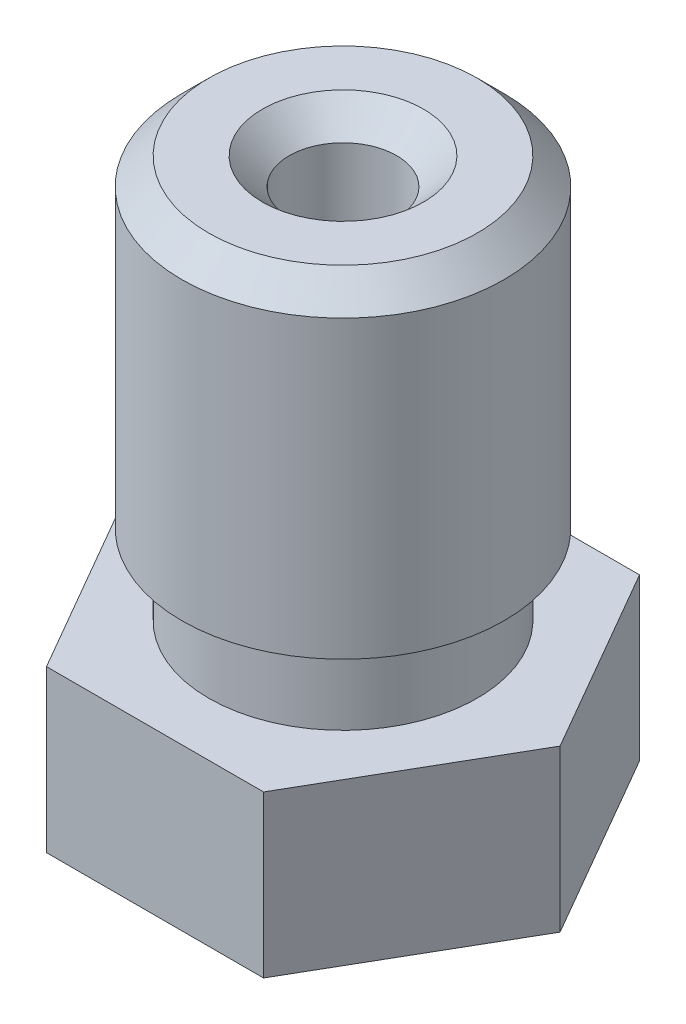
ISO-10303-21;
HEADER;
FILE_DESCRIPTION(('STEP AP214'),'2;1');
FILE_NAME('part.step','',(''),(''),'','','');
FILE_SCHEMA(('AUTOMOTIVE_DESIGN { 1 0 10303 214 1 1 1 1 }'));
ENDSEC;
DATA;
#1=APPLICATION_CONTEXT('core data for automotive mechanical design processes');
#2=APPLICATION_PROTOCOL_DEFINITION('international standard','automotive_design',2000,#1);
#3=PRODUCT_CONTEXT('',#1,'mechanical');
#4=PRODUCT('Part','Part','',(#3));
#5=PRODUCT_RELATED_PRODUCT_CATEGORY('part','',(#4));
#6=PRODUCT_DEFINITION_FORMATION('','',#4);
#7=PRODUCT_DEFINITION_CONTEXT('part definition',#1,'design');
#8=PRODUCT_DEFINITION('design','',#6,#7);
#9=PRODUCT_DEFINITION_SHAPE('','',#8);
#10=(LENGTH_UNIT() NAMED_UNIT(*) SI_UNIT(.MILLI.,.METRE.));
#11=(NAMED_UNIT(*) PLANE_ANGLE_UNIT() SI_UNIT($,.RADIAN.));
#12=(NAMED_UNIT(*) SI_UNIT($,.STERADIAN.) SOLID_ANGLE_UNIT());
#13=UNCERTAINTY_MEASURE_WITH_UNIT(LENGTH_MEASURE(1.E-05),#10,'distance_accuracy_value','');
#14=(GEOMETRIC_REPRESENTATION_CONTEXT(3) GLOBAL_UNCERTAINTY_ASSIGNED_CONTEXT((#13)) GLOBAL_UNIT_ASSIGNED_CONTEXT((#10,
#11,#12)) REPRESENTATION_CONTEXT('',''));
#15=CARTESIAN_POINT('',(0.,0.,0.));
#16=DIRECTION('',(0.,0.,1.));
#17=DIRECTION('',(1.,0.,0.));
#18=AXIS2_PLACEMENT_3D('',#15,#16,#17);
#19=CARTESIAN_POINT('',(2.02072594216369,3.,3.5));
#20=DIRECTION('',(0.,0.,1.));
#21=DIRECTION('',(1.,0.,0.));
#22=AXIS2_PLACEMENT_3D('',#19,#20,#21);
#23=PLANE('',#22);
#24=DIRECTION('',(-1.,0.,0.));
#25=VECTOR('',#24,1.);
#26=CARTESIAN_POINT('',(2.02072594216369,0.,3.5));
#27=LINE('',#26,#25);
#28=CARTESIAN_POINT('',(2.02072594216369,0.,3.5));
#29=VERTEX_POINT('',#28);
#30=CARTESIAN_POINT('',(-2.02072594216369,0.,3.5));
#31=VERTEX_POINT('',#30);
#32=EDGE_CURVE('E123',#29,#31,#27,.T.);
#33=ORIENTED_EDGE('',*,*,#32,.F.);
#34=DIRECTION('',(0.,-1.,0.));
#35=VECTOR('',#34,1.);
#36=CARTESIAN_POINT('',(2.02072594216369,3.,3.5));
#37=LINE('',#36,#35);
#38=CARTESIAN_POINT('',(2.02072594216369,3.,3.5));
#39=VERTEX_POINT('',#38);
#40=EDGE_CURVE('E52',#39,#29,#37,.T.);
#41=ORIENTED_EDGE('',*,*,#40,.F.);
#42=DIRECTION('',(-1.,0.,0.));
#43=VECTOR('',#42,1.);
#44=CARTESIAN_POINT('',(2.02072594216369,3.,3.5));
#45=LINE('',#44,#43);
#46=CARTESIAN_POINT('',(-2.02072594216369,3.,3.5));
#47=VERTEX_POINT('',#46);
#48=EDGE_CURVE('E139',#39,#47,#45,.T.);
#49=ORIENTED_EDGE('',*,*,#48,.T.);
#50=DIRECTION('',(0.,-1.,0.));
#51=VECTOR('',#50,1.);
#52=CARTESIAN_POINT('',(-2.02072594216369,3.,3.5));
#53=LINE('',#52,#51);
#54=EDGE_CURVE('E87',#47,#31,#53,.T.);
#55=ORIENTED_EDGE('',*,*,#54,.T.);
#56=EDGE_LOOP('',(#33,#41,#49,#55));
#57=FACE_BOUND('',#56,.T.);
#58=ADVANCED_FACE('F35',(#57),#23,.T.);
#59=CARTESIAN_POINT('',(4.04145188432738,3.,0.));
#60=DIRECTION('',(0.866025403784439,0.,0.5));
#61=DIRECTION('',(0.5,0.,-0.866025403784439));
#62=AXIS2_PLACEMENT_3D('',#59,#60,#61);
#63=PLANE('',#62);
#64=DIRECTION('',(-0.5,0.,0.866025403784439));
#65=VECTOR('',#64,1.);
#66=CARTESIAN_POINT('',(4.04145188432738,0.,0.));
#67=LINE('',#66,#65);
#68=CARTESIAN_POINT('',(4.04145188432738,0.,0.));
#69=VERTEX_POINT('',#68);
#70=EDGE_CURVE('E136',#69,#29,#67,.T.);
#71=ORIENTED_EDGE('',*,*,#70,.F.);
#72=DIRECTION('',(0.,-1.,0.));
#73=VECTOR('',#72,1.);
#74=CARTESIAN_POINT('',(4.04145188432738,3.,0.));
#75=LINE('',#74,#73);
#76=CARTESIAN_POINT('',(4.04145188432738,3.,0.));
#77=VERTEX_POINT('',#76);
#78=EDGE_CURVE('E75',#77,#69,#75,.T.);
#79=ORIENTED_EDGE('',*,*,#78,.F.);
#80=DIRECTION('',(-0.5,0.,0.866025403784439));
#81=VECTOR('',#80,1.);
#82=CARTESIAN_POINT('',(4.04145188432738,3.,0.));
#83=LINE('',#82,#81);
#84=EDGE_CURVE('E113',#77,#39,#83,.T.);
#85=ORIENTED_EDGE('',*,*,#84,.T.);
#86=ORIENTED_EDGE('',*,*,#40,.T.);
#87=EDGE_LOOP('',(#71,#79,#85,#86));
#88=FACE_BOUND('',#87,.T.);
#89=ADVANCED_FACE('F212',(#88),#63,.T.);
#90=CARTESIAN_POINT('',(2.02072594216369,3.,-3.5));
#91=DIRECTION('',(0.866025403784438,0.,-0.500000000000001));
#92=DIRECTION('',(-0.500000000000001,0.,-0.866025403784438));
#93=AXIS2_PLACEMENT_3D('',#90,#91,#92);
#94=PLANE('',#93);
#95=DIRECTION('',(0.500000000000001,0.,0.866025403784438));
#96=VECTOR('',#95,1.);
#97=CARTESIAN_POINT('',(2.02072594216369,0.,-3.5));
#98=LINE('',#97,#96);
#99=CARTESIAN_POINT('',(2.02072594216369,0.,-3.5));
#100=VERTEX_POINT('',#99);
#101=EDGE_CURVE('E100',#100,#69,#98,.T.);
#102=ORIENTED_EDGE('',*,*,#101,.F.);
#103=DIRECTION('',(0.,-1.,0.));
#104=VECTOR('',#103,1.);
#105=CARTESIAN_POINT('',(2.02072594216369,3.,-3.5));
#106=LINE('',#105,#104);
#107=CARTESIAN_POINT('',(2.02072594216369,3.,-3.5));
#108=VERTEX_POINT('',#107);
#109=EDGE_CURVE('E95',#108,#100,#106,.T.);
#110=ORIENTED_EDGE('',*,*,#109,.F.);
#111=DIRECTION('',(0.500000000000001,0.,0.866025403784438));
#112=VECTOR('',#111,1.);
#113=CARTESIAN_POINT('',(2.02072594216369,3.,-3.5));
#114=LINE('',#113,#112);
#115=EDGE_CURVE('E98',#108,#77,#114,.T.);
#116=ORIENTED_EDGE('',*,*,#115,.T.);
#117=ORIENTED_EDGE('',*,*,#78,.T.);
#118=EDGE_LOOP('',(#102,#110,#116,#117));
#119=FACE_BOUND('',#118,.T.);
#120=ADVANCED_FACE('F97',(#119),#94,.T.);
#121=CARTESIAN_POINT('',(-2.02072594216369,3.,-3.5));
#122=DIRECTION('',(0.,0.,-1.));
#123=DIRECTION('',(-1.,0.,0.));
#124=AXIS2_PLACEMENT_3D('',#121,#122,#123);
#125=PLANE('',#124);
#126=DIRECTION('',(1.,0.,0.));
#127=VECTOR('',#126,1.);
#128=CARTESIAN_POINT('',(-2.02072594216369,0.,-3.5));
#129=LINE('',#128,#127);
#130=CARTESIAN_POINT('',(-2.02072594216369,0.,-3.5));
#131=VERTEX_POINT('',#130);
#132=EDGE_CURVE('E133',#131,#100,#129,.T.);
#133=ORIENTED_EDGE('',*,*,#132,.F.);
#134=DIRECTION('',(0.,-1.,0.));
#135=VECTOR('',#134,1.);
#136=CARTESIAN_POINT('',(-2.02072594216369,3.,-3.5));
#137=LINE('',#136,#135);
#138=CARTESIAN_POINT('',(-2.02072594216369,3.,-3.5));
#139=VERTEX_POINT('',#138);
#140=EDGE_CURVE('E105',#139,#131,#137,.T.);
#141=ORIENTED_EDGE('',*,*,#140,.F.);
#142=DIRECTION('',(1.,0.,0.));
#143=VECTOR('',#142,1.);
#144=CARTESIAN_POINT('',(-2.02072594216369,3.,-3.5));
#145=LINE('',#144,#143);
#146=EDGE_CURVE('E111',#139,#108,#145,.T.);
#147=ORIENTED_EDGE('',*,*,#146,.T.);
#148=ORIENTED_EDGE('',*,*,#109,.T.);
#149=EDGE_LOOP('',(#133,#141,#147,#148));
#150=FACE_BOUND('',#149,.T.);
#151=ADVANCED_FACE('F115',(#150),#125,.T.);
#152=CARTESIAN_POINT('',(-4.04145188432738,3.,0.));
#153=DIRECTION('',(-0.866025403784439,0.,-0.5));
#154=DIRECTION('',(-0.5,0.,0.866025403784439));
#155=AXIS2_PLACEMENT_3D('',#152,#153,#154);
#156=PLANE('',#155);
#157=DIRECTION('',(0.5,0.,-0.866025403784439));
#158=VECTOR('',#157,1.);
#159=CARTESIAN_POINT('',(-4.04145188432738,0.,0.));
#160=LINE('',#159,#158);
#161=CARTESIAN_POINT('',(-4.04145188432738,0.,0.));
#162=VERTEX_POINT('',#161);
#163=EDGE_CURVE('E130',#162,#131,#160,.T.);
#164=ORIENTED_EDGE('',*,*,#163,.F.);
#165=DIRECTION('',(0.,-1.,0.));
#166=VECTOR('',#165,1.);
#167=CARTESIAN_POINT('',(-4.04145188432738,3.,0.));
#168=LINE('',#167,#166);
#169=CARTESIAN_POINT('',(-4.04145188432738,3.,0.));
#170=VERTEX_POINT('',#169);
#171=EDGE_CURVE('E144',#170,#162,#168,.T.);
#172=ORIENTED_EDGE('',*,*,#171,.F.);
#173=DIRECTION('',(0.5,0.,-0.866025403784439));
#174=VECTOR('',#173,1.);
#175=CARTESIAN_POINT('',(-4.04145188432738,3.,0.));
#176=LINE('',#175,#174);
#177=EDGE_CURVE('E116',#170,#139,#176,.T.);
#178=ORIENTED_EDGE('',*,*,#177,.T.);
#179=ORIENTED_EDGE('',*,*,#140,.T.);
#180=EDGE_LOOP('',(#164,#172,#178,#179));
#181=FACE_BOUND('',#180,.T.);
#182=ADVANCED_FACE('F226',(#181),#156,.T.);
#183=CARTESIAN_POINT('',(-2.02072594216369,3.,3.5));
#184=DIRECTION('',(-0.866025403784439,0.,0.5));
#185=DIRECTION('',(0.5,0.,0.866025403784439));
#186=AXIS2_PLACEMENT_3D('',#183,#184,#185);
#187=PLANE('',#186);
#188=DIRECTION('',(-0.5,0.,-0.866025403784439));
#189=VECTOR('',#188,1.);
#190=CARTESIAN_POINT('',(-2.02072594216369,0.,3.5));
#191=LINE('',#190,#189);
#192=EDGE_CURVE('E126',#31,#162,#191,.T.);
#193=ORIENTED_EDGE('',*,*,#192,.F.);
#194=ORIENTED_EDGE('',*,*,#54,.F.);
#195=DIRECTION('',(-0.5,0.,-0.866025403784439));
#196=VECTOR('',#195,1.);
#197=CARTESIAN_POINT('',(-2.02072594216369,3.,3.5));
#198=LINE('',#197,#196);
#199=EDGE_CURVE('E118',#47,#170,#198,.T.);
#200=ORIENTED_EDGE('',*,*,#199,.T.);
#201=ORIENTED_EDGE('',*,*,#171,.T.);
#202=EDGE_LOOP('',(#193,#194,#200,#201));
#203=FACE_BOUND('',#202,.T.);
#204=ADVANCED_FACE('F208',(#203),#187,.T.);
#205=CARTESIAN_POINT('',(0.,3.,0.));
#206=DIRECTION('',(0.,-1.,0.));
#207=DIRECTION('',(0.,0.,-1.));
#208=AXIS2_PLACEMENT_3D('',#205,#206,#207);
#209=PLANE('',#208);
#210=CARTESIAN_POINT('',(0.,3.,0.));
#211=DIRECTION('',(0.,1.,0.));
#212=DIRECTION('',(0.,0.,1.));
#213=AXIS2_PLACEMENT_3D('',#210,#211,#212);
#214=CIRCLE('',#213,2.5);
#215=CARTESIAN_POINT('',(0.,3.,2.5));
#216=VERTEX_POINT('',#215);
#217=EDGE_CURVE('E127',#216,#216,#214,.T.);
#218=ORIENTED_EDGE('',*,*,#217,.F.);
#219=EDGE_LOOP('',(#218));
#220=FACE_BOUND('',#219,.T.);
#221=ORIENTED_EDGE('',*,*,#48,.F.);
#222=ORIENTED_EDGE('',*,*,#84,.F.);
#223=ORIENTED_EDGE('',*,*,#115,.F.);
#224=ORIENTED_EDGE('',*,*,#146,.F.);
#225=ORIENTED_EDGE('',*,*,#177,.F.);
#226=ORIENTED_EDGE('',*,*,#199,.F.);
#227=EDGE_LOOP('',(#221,#222,#223,#224,#225,#226));
#228=FACE_BOUND('',#227,.T.);
#229=ADVANCED_FACE('F109',(#220,#228),#209,.F.);
#230=CARTESIAN_POINT('',(0.,0.,0.));
#231=DIRECTION('',(0.,-1.,0.));
#232=DIRECTION('',(0.,0.,-1.));
#233=AXIS2_PLACEMENT_3D('',#230,#231,#232);
#234=PLANE('',#233);
#235=CARTESIAN_POINT('',(0.,0.,0.));
#236=DIRECTION('',(0.,-1.,0.));
#237=DIRECTION('',(0.,0.,-1.));
#238=AXIS2_PLACEMENT_3D('',#235,#236,#237);
#239=CIRCLE('',#238,2.50000000004502);
#240=CARTESIAN_POINT('',(0.,0.,-2.50000000004502));
#241=VERTEX_POINT('',#240);
#242=EDGE_CURVE('E141',#241,#241,#239,.T.);
#243=ORIENTED_EDGE('',*,*,#242,.F.);
#244=EDGE_LOOP('',(#243));
#245=FACE_BOUND('',#244,.T.);
#246=ORIENTED_EDGE('',*,*,#32,.T.);
#247=ORIENTED_EDGE('',*,*,#192,.T.);
#248=ORIENTED_EDGE('',*,*,#163,.T.);
#249=ORIENTED_EDGE('',*,*,#132,.T.);
#250=ORIENTED_EDGE('',*,*,#101,.T.);
#251=ORIENTED_EDGE('',*,*,#70,.T.);
#252=EDGE_LOOP('',(#246,#247,#248,#249,#250,#251));
#253=FACE_BOUND('',#252,.T.);
#254=ADVANCED_FACE('F211',(#245,#253),#234,.T.);
#255=CARTESIAN_POINT('',(0.,3.,0.));
#256=DIRECTION('',(0.,1.,0.));
#257=DIRECTION('',(0.,0.,1.));
#258=AXIS2_PLACEMENT_3D('',#255,#256,#257);
#259=CYLINDRICAL_SURFACE('',#258,2.5);
#260=ORIENTED_EDGE('',*,*,#217,.T.);
#261=EDGE_LOOP('',(#260));
#262=FACE_BOUND('',#261,.T.);
#263=CARTESIAN_POINT('',(0.,4.5,0.));
#264=DIRECTION('',(0.,1.,0.));
#265=DIRECTION('',(0.,0.,1.));
#266=AXIS2_PLACEMENT_3D('',#263,#264,#265);
#267=CIRCLE('',#266,2.5);
#268=CARTESIAN_POINT('',(0.,4.5,2.5));
#269=VERTEX_POINT('',#268);
#270=EDGE_CURVE('E200',#269,#269,#267,.T.);
#271=ORIENTED_EDGE('',*,*,#270,.F.);
#272=EDGE_LOOP('',(#271));
#273=FACE_BOUND('',#272,.T.);
#274=ADVANCED_FACE('F169',(#262,#273),#259,.T.);
#275=CARTESIAN_POINT('',(0.,10.5,0.));
#276=DIRECTION('',(0.,1.,0.));
#277=DIRECTION('',(0.,0.,1.));
#278=AXIS2_PLACEMENT_3D('',#275,#276,#277);
#279=PLANE('',#278);
#280=CARTESIAN_POINT('',(0.,10.5,0.));
#281=DIRECTION('',(0.,1.,0.));
#282=DIRECTION('',(0.,0.,1.));
#283=AXIS2_PLACEMENT_3D('',#280,#281,#282);
#284=CIRCLE('',#283,2.4999999999834);
#285=CARTESIAN_POINT('',(0.,10.5,2.4999999999834));
#286=VERTEX_POINT('',#285);
#287=EDGE_CURVE('E152',#286,#286,#284,.T.);
#288=ORIENTED_EDGE('',*,*,#287,.T.);
#289=EDGE_LOOP('',(#288));
#290=FACE_BOUND('',#289,.T.);
#291=CARTESIAN_POINT('',(-1.10963134903613E-11,10.5,0.));
#292=DIRECTION('',(0.,1.,0.));
#293=DIRECTION('',(0.,0.,1.));
#294=AXIS2_PLACEMENT_3D('',#291,#292,#293);
#295=CIRCLE('',#294,1.5000000000277);
#296=CARTESIAN_POINT('',(-1.10963134903613E-11,10.5,1.5000000000277));
#297=VERTEX_POINT('',#296);
#298=EDGE_CURVE('E149',#297,#297,#295,.F.);
#299=ORIENTED_EDGE('',*,*,#298,.T.);
#300=EDGE_LOOP('',(#299));
#301=FACE_BOUND('',#300,.T.);
#302=ADVANCED_FACE('F166',(#290,#301),#279,.T.);
#303=CARTESIAN_POINT('',(0.,3.,0.));
#304=DIRECTION('',(0.,1.,0.));
#305=DIRECTION('',(0.,0.,1.));
#306=AXIS2_PLACEMENT_3D('',#303,#304,#305);
#307=CYLINDRICAL_SURFACE('',#306,3.);
#308=CARTESIAN_POINT('',(0.,9.9999999999834,0.));
#309=DIRECTION('',(0.,1.,0.));
#310=DIRECTION('',(0.,0.,1.));
#311=AXIS2_PLACEMENT_3D('',#308,#309,#310);
#312=CIRCLE('',#311,3.);
#313=CARTESIAN_POINT('',(0.,9.9999999999834,3.));
#314=VERTEX_POINT('',#313);
#315=EDGE_CURVE('E44',#314,#314,#312,.F.);
#316=ORIENTED_EDGE('',*,*,#315,.T.);
#317=EDGE_LOOP('',(#316));
#318=FACE_BOUND('',#317,.T.);
#319=CARTESIAN_POINT('',(0.,4.5,0.));
#320=DIRECTION('',(0.,1.,0.));
#321=DIRECTION('',(0.,0.,1.));
#322=AXIS2_PLACEMENT_3D('',#319,#320,#321);
#323=CIRCLE('',#322,3.);
#324=CARTESIAN_POINT('',(0.,4.5,3.));
#325=VERTEX_POINT('',#324);
#326=EDGE_CURVE('E203',#325,#325,#323,.T.);
#327=ORIENTED_EDGE('',*,*,#326,.T.);
#328=EDGE_LOOP('',(#327));
#329=FACE_BOUND('',#328,.T.);
#330=ADVANCED_FACE('F157',(#318,#329),#307,.T.);
#331=CARTESIAN_POINT('',(3.,4.5,0.));
#332=DIRECTION('',(0.,-1.,0.));
#333=DIRECTION('',(0.,0.,-1.));
#334=AXIS2_PLACEMENT_3D('',#331,#332,#333);
#335=PLANE('',#334);
#336=ORIENTED_EDGE('',*,*,#270,.T.);
#337=EDGE_LOOP('',(#336));
#338=FACE_BOUND('',#337,.T.);
#339=ORIENTED_EDGE('',*,*,#326,.F.);
#340=EDGE_LOOP('',(#339));
#341=FACE_BOUND('',#340,.T.);
#342=ADVANCED_FACE('F246',(#338,#341),#335,.T.);
#343=CARTESIAN_POINT('',(0.,-2.,0.));
#344=DIRECTION('',(0.,1.,0.));
#345=DIRECTION('',(-1.,0.,0.));
#346=AXIS2_PLACEMENT_3D('',#343,#344,#345);
#347=CONICAL_SURFACE('',#346,0.50000000004502,0.785398163397449);
#348=ORIENTED_EDGE('',*,*,#242,.T.);
#349=EDGE_LOOP('',(#348));
#350=FACE_BOUND('',#349,.T.);
#351=CARTESIAN_POINT('',(0.,-2.,0.));
#352=DIRECTION('',(0.,-1.,0.));
#353=DIRECTION('',(1.,0.,0.));
#354=AXIS2_PLACEMENT_3D('',#351,#352,#353);
#355=CIRCLE('',#354,0.50000000004502);
#356=CARTESIAN_POINT('',(0.50000000004502,-2.,0.));
#357=VERTEX_POINT('',#356);
#358=EDGE_CURVE('E191',#357,#357,#355,.T.);
#359=ORIENTED_EDGE('',*,*,#358,.F.);
#360=EDGE_LOOP('',(#359));
#361=FACE_BOUND('',#360,.T.);
#362=ADVANCED_FACE('F249',(#350,#361),#347,.T.);
#363=CARTESIAN_POINT('',(0.,-2.,0.));
#364=DIRECTION('',(0.,-1.,0.));
#365=DIRECTION('',(1.,0.,0.));
#366=AXIS2_PLACEMENT_3D('',#363,#364,#365);
#367=PLANE('',#366);
#368=CARTESIAN_POINT('',(-1.10963134903613E-11,-2.,0.));
#369=DIRECTION('',(0.,1.,0.));
#370=DIRECTION('',(0.,0.,1.));
#371=AXIS2_PLACEMENT_3D('',#368,#369,#370);
#372=CIRCLE('',#371,0.2);
#373=CARTESIAN_POINT('',(-1.10963134903613E-11,-2.,0.2));
#374=VERTEX_POINT('',#373);
#375=EDGE_CURVE('E187',#374,#374,#372,.T.);
#376=ORIENTED_EDGE('',*,*,#375,.T.);
#377=EDGE_LOOP('',(#376));
#378=FACE_BOUND('',#377,.T.);
#379=ORIENTED_EDGE('',*,*,#358,.T.);
#380=EDGE_LOOP('',(#379));
#381=FACE_BOUND('',#380,.T.);
#382=ADVANCED_FACE('F253',(#378,#381),#367,.T.);
#383=CARTESIAN_POINT('',(-1.10963134903613E-11,-2.,0.));
#384=DIRECTION('',(0.,1.,0.));
#385=DIRECTION('',(0.,0.,1.));
#386=AXIS2_PLACEMENT_3D('',#383,#384,#385);
#387=CYLINDRICAL_SURFACE('',#386,0.2);
#388=ORIENTED_EDGE('',*,*,#375,.F.);
#389=EDGE_LOOP('',(#388));
#390=FACE_BOUND('',#389,.T.);
#391=CARTESIAN_POINT('',(-1.10963134903613E-11,-1.20000000003984,0.));
#392=DIRECTION('',(0.,1.,0.));
#393=DIRECTION('',(0.,0.,1.));
#394=AXIS2_PLACEMENT_3D('',#391,#392,#393);
#395=CIRCLE('',#394,0.2);
#396=CARTESIAN_POINT('',(-1.10963134903613E-11,-1.20000000003984,0.2));
#397=VERTEX_POINT('',#396);
#398=EDGE_CURVE('E275',#397,#397,#395,.T.);
#399=ORIENTED_EDGE('',*,*,#398,.T.);
#400=EDGE_LOOP('',(#399));
#401=FACE_BOUND('',#400,.T.);
#402=ADVANCED_FACE('F181',(#390,#401),#387,.F.);
#403=CARTESIAN_POINT('',(-1.10963134903613E-11,-2.,0.));
#404=DIRECTION('',(0.,1.,0.));
#405=DIRECTION('',(0.,0.,1.));
#406=AXIS2_PLACEMENT_3D('',#403,#404,#405);
#407=CYLINDRICAL_SURFACE('',#406,1.0000000000111);
#408=CARTESIAN_POINT('',(-1.10963134903613E-11,9.9999999999834,0.));
#409=DIRECTION('',(0.,1.,0.));
#410=DIRECTION('',(0.,0.,1.));
#411=AXIS2_PLACEMENT_3D('',#408,#409,#410);
#412=CIRCLE('',#411,1.0000000000111);
#413=CARTESIAN_POINT('',(-1.10963134903613E-11,9.9999999999834,1.0000000000111));
#414=VERTEX_POINT('',#413);
#415=EDGE_CURVE('E11',#414,#414,#412,.T.);
#416=ORIENTED_EDGE('',*,*,#415,.T.);
#417=EDGE_LOOP('',(#416));
#418=FACE_BOUND('',#417,.T.);
#419=CARTESIAN_POINT('',(-1.10963134903613E-11,0.,0.));
#420=DIRECTION('',(0.,1.,0.));
#421=DIRECTION('',(0.,0.,1.));
#422=AXIS2_PLACEMENT_3D('',#419,#420,#421);
#423=CIRCLE('',#422,1.0000000000111);
#424=CARTESIAN_POINT('',(-1.10963134903613E-11,0.,1.0000000000111));
#425=VERTEX_POINT('',#424);
#426=EDGE_CURVE('E185',#425,#425,#423,.T.);
#427=ORIENTED_EDGE('',*,*,#426,.F.);
#428=EDGE_LOOP('',(#427));
#429=FACE_BOUND('',#428,.T.);
#430=ADVANCED_FACE('F177',(#418,#429),#407,.F.);
#431=CARTESIAN_POINT('',(-1.10963134903613E-11,0.,0.));
#432=DIRECTION('',(0.,1.,0.));
#433=DIRECTION('',(0.,0.,1.));
#434=AXIS2_PLACEMENT_3D('',#431,#432,#433);
#435=CONICAL_SURFACE('',#434,1.0000000000111,0.832981266710198);
#436=CARTESIAN_POINT('',(-1.10963134903613E-11,-0.227272727272521,0.));
#437=DIRECTION('',(0.,1.,0.));
#438=DIRECTION('',(0.,0.,1.));
#439=AXIS2_PLACEMENT_3D('',#436,#437,#438);
#440=CIRCLE('',#439,0.749999999993361);
#441=CARTESIAN_POINT('',(-1.10963134903613E-11,-0.227272727272521,0.749999999993361));
#442=VERTEX_POINT('',#441);
#443=EDGE_CURVE('E188',#442,#442,#440,.T.);
#444=ORIENTED_EDGE('',*,*,#443,.F.);
#445=EDGE_LOOP('',(#444));
#446=FACE_BOUND('',#445,.T.);
#447=ORIENTED_EDGE('',*,*,#426,.T.);
#448=EDGE_LOOP('',(#447));
#449=FACE_BOUND('',#448,.T.);
#450=ADVANCED_FACE('F180',(#446,#449),#435,.F.);
#451=CARTESIAN_POINT('',(-1.10963134903613E-11,-2.,0.));
#452=DIRECTION('',(0.,1.,0.));
#453=DIRECTION('',(0.,0.,1.));
#454=AXIS2_PLACEMENT_3D('',#451,#452,#453);
#455=CYLINDRICAL_SURFACE('',#454,0.749999999993361);
#456=CARTESIAN_POINT('',(-1.10963134903613E-11,-0.700000000000002,0.));
#457=DIRECTION('',(0.,1.,0.));
#458=DIRECTION('',(0.,0.,1.));
#459=AXIS2_PLACEMENT_3D('',#456,#457,#458);
#460=CIRCLE('',#459,0.749999999993361);
#461=CARTESIAN_POINT('',(-1.10963134903613E-11,-0.700000000000002,0.749999999993361));
#462=VERTEX_POINT('',#461);
#463=EDGE_CURVE('E194',#462,#462,#460,.T.);
#464=ORIENTED_EDGE('',*,*,#463,.F.);
#465=EDGE_LOOP('',(#464));
#466=FACE_BOUND('',#465,.T.);
#467=ORIENTED_EDGE('',*,*,#443,.T.);
#468=EDGE_LOOP('',(#467));
#469=FACE_BOUND('',#468,.T.);
#470=ADVANCED_FACE('F263',(#466,#469),#455,.F.);
#471=CARTESIAN_POINT('',(-1.10963134903613E-11,-0.700000000000002,0.));
#472=DIRECTION('',(0.,1.,0.));
#473=DIRECTION('',(0.,0.,1.));
#474=AXIS2_PLACEMENT_3D('',#471,#472,#473);
#475=CONICAL_SURFACE('',#474,0.749999999993361,0.832981266628769);
#476=ORIENTED_EDGE('',*,*,#398,.F.);
#477=EDGE_LOOP('',(#476));
#478=FACE_BOUND('',#477,.T.);
#479=ORIENTED_EDGE('',*,*,#463,.T.);
#480=EDGE_LOOP('',(#479));
#481=FACE_BOUND('',#480,.T.);
#482=ADVANCED_FACE('F163',(#478,#481),#475,.F.);
#483=CARTESIAN_POINT('',(0.,10.5,0.));
#484=DIRECTION('',(0.,-1.,0.));
#485=DIRECTION('',(0.,0.,-1.));
#486=AXIS2_PLACEMENT_3D('',#483,#484,#485);
#487=CONICAL_SURFACE('',#486,2.4999999999834,0.785398163397446);
#488=ORIENTED_EDGE('',*,*,#315,.F.);
#489=EDGE_LOOP('',(#488));
#490=FACE_BOUND('',#489,.T.);
#491=ORIENTED_EDGE('',*,*,#287,.F.);
#492=EDGE_LOOP('',(#491));
#493=FACE_BOUND('',#492,.T.);
#494=ADVANCED_FACE('F160',(#490,#493),#487,.T.);
#495=CARTESIAN_POINT('',(-1.10963134903613E-11,9.9999999999834,0.));
#496=DIRECTION('',(0.,1.,0.));
#497=DIRECTION('',(0.,0.,1.));
#498=AXIS2_PLACEMENT_3D('',#495,#496,#497);
#499=CONICAL_SURFACE('',#498,1.0000000000111,0.785398163397452);
#500=ORIENTED_EDGE('',*,*,#298,.F.);
#501=EDGE_LOOP('',(#500));
#502=FACE_BOUND('',#501,.T.);
#503=ORIENTED_EDGE('',*,*,#415,.F.);
#504=EDGE_LOOP('',(#503));
#505=FACE_BOUND('',#504,.T.);
#506=ADVANCED_FACE('F37',(#502,#505),#499,.F.);
#507=CLOSED_SHELL('',(#58,#89,#120,#151,#182,#204,#229,#254,#274,#302,#330,#342,#362,#382,#402,
#430,#450,#470,#482,#494,#506));
#508=MANIFOLD_SOLID_BREP('B2',#507);
#509=ADVANCED_BREP_SHAPE_REPRESENTATION('',(#18,#508),#14);
#510=SHAPE_DEFINITION_REPRESENTATION(#9,#509);
ENDSEC;
END-ISO-10303-21;
